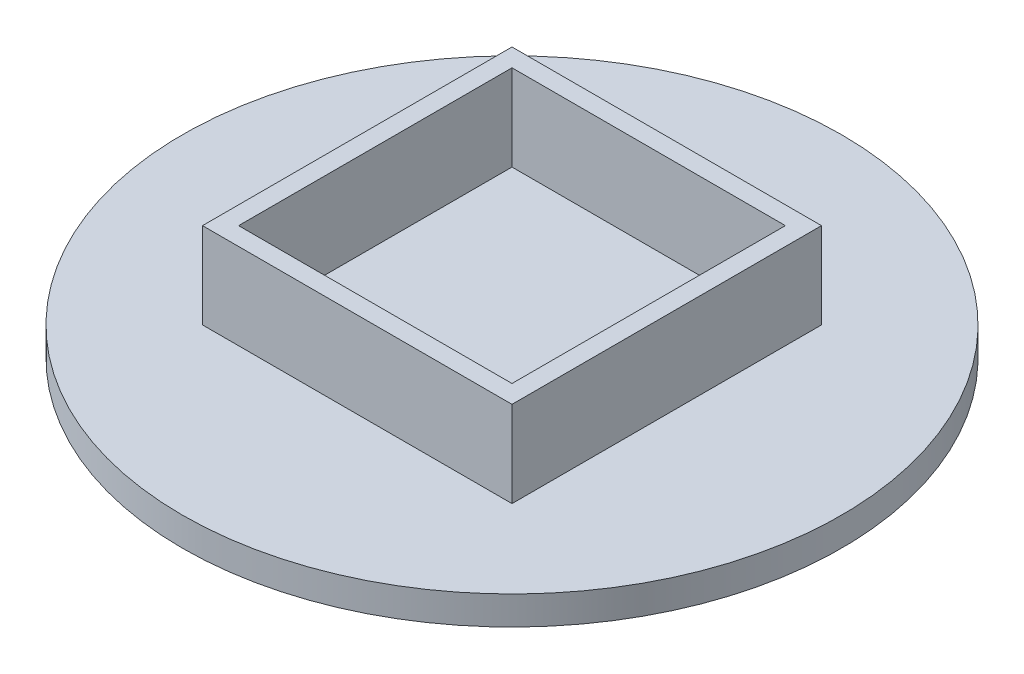
ISO-10303-21;
HEADER;
FILE_DESCRIPTION(('STEP AP214'),'2;1');
FILE_NAME('part.step','',(''),(''),'','','');
FILE_SCHEMA(('AUTOMOTIVE_DESIGN { 1 0 10303 214 1 1 1 1 }'));
ENDSEC;
DATA;
#1=APPLICATION_CONTEXT('core data for automotive mechanical design processes');
#2=APPLICATION_PROTOCOL_DEFINITION('international standard','automotive_design',2000,#1);
#3=PRODUCT_CONTEXT('',#1,'mechanical');
#4=PRODUCT('Part','Part','',(#3));
#5=PRODUCT_RELATED_PRODUCT_CATEGORY('part','',(#4));
#6=PRODUCT_DEFINITION_FORMATION('','',#4);
#7=PRODUCT_DEFINITION_CONTEXT('part definition',#1,'design');
#8=PRODUCT_DEFINITION('design','',#6,#7);
#9=PRODUCT_DEFINITION_SHAPE('','',#8);
#10=(LENGTH_UNIT() NAMED_UNIT(*) SI_UNIT(.MILLI.,.METRE.));
#11=(NAMED_UNIT(*) PLANE_ANGLE_UNIT() SI_UNIT($,.RADIAN.));
#12=(NAMED_UNIT(*) SI_UNIT($,.STERADIAN.) SOLID_ANGLE_UNIT());
#13=UNCERTAINTY_MEASURE_WITH_UNIT(LENGTH_MEASURE(1.E-05),#10,'distance_accuracy_value','');
#14=(GEOMETRIC_REPRESENTATION_CONTEXT(3) GLOBAL_UNCERTAINTY_ASSIGNED_CONTEXT((#13)) GLOBAL_UNIT_ASSIGNED_CONTEXT((#10,
#11,#12)) REPRESENTATION_CONTEXT('',''));
#15=CARTESIAN_POINT('',(0.,0.,0.));
#16=DIRECTION('',(0.,0.,1.));
#17=DIRECTION('',(1.,0.,0.));
#18=AXIS2_PLACEMENT_3D('',#15,#16,#17);
#19=CARTESIAN_POINT('',(0.,25.4,-30.29));
#20=DIRECTION('',(0.,0.,-1.));
#21=DIRECTION('',(-1.,0.,0.));
#22=AXIS2_PLACEMENT_3D('',#19,#20,#21);
#23=PLANE('',#22);
#24=DIRECTION('',(0.,-1.,0.));
#25=VECTOR('',#24,1.);
#26=CARTESIAN_POINT('',(-30.2900000000001,25.4,-30.29));
#27=LINE('',#26,#25);
#28=CARTESIAN_POINT('',(-30.2900000000001,25.4,-30.29));
#29=VERTEX_POINT('',#28);
#30=CARTESIAN_POINT('',(-30.2900000000001,6.35,-30.29));
#31=VERTEX_POINT('',#30);
#32=EDGE_CURVE('E112',#29,#31,#27,.T.);
#33=ORIENTED_EDGE('',*,*,#32,.T.);
#34=DIRECTION('',(1.,0.,0.));
#35=VECTOR('',#34,1.);
#36=CARTESIAN_POINT('',(0.,6.35,-30.29));
#37=LINE('',#36,#35);
#38=CARTESIAN_POINT('',(30.29,6.35,-30.29));
#39=VERTEX_POINT('',#38);
#40=EDGE_CURVE('E51',#31,#39,#37,.T.);
#41=ORIENTED_EDGE('',*,*,#40,.T.);
#42=DIRECTION('',(0.,-1.,0.));
#43=VECTOR('',#42,1.);
#44=CARTESIAN_POINT('',(30.29,25.4,-30.29));
#45=LINE('',#44,#43);
#46=CARTESIAN_POINT('',(30.29,25.4,-30.29));
#47=VERTEX_POINT('',#46);
#48=EDGE_CURVE('E44',#47,#39,#45,.T.);
#49=ORIENTED_EDGE('',*,*,#48,.F.);
#50=DIRECTION('',(1.,0.,0.));
#51=VECTOR('',#50,1.);
#52=CARTESIAN_POINT('',(0.,25.4,-30.29));
#53=LINE('',#52,#51);
#54=EDGE_CURVE('E144',#29,#47,#53,.T.);
#55=ORIENTED_EDGE('',*,*,#54,.F.);
#56=EDGE_LOOP('',(#33,#41,#49,#55));
#57=FACE_BOUND('',#56,.T.);
#58=ADVANCED_FACE('F36',(#57),#23,.F.);
#59=CARTESIAN_POINT('',(30.29,25.4,0.));
#60=DIRECTION('',(1.,0.,0.));
#61=DIRECTION('',(0.,0.,-1.));
#62=AXIS2_PLACEMENT_3D('',#59,#60,#61);
#63=PLANE('',#62);
#64=ORIENTED_EDGE('',*,*,#48,.T.);
#65=DIRECTION('',(0.,0.,1.));
#66=VECTOR('',#65,1.);
#67=CARTESIAN_POINT('',(30.29,6.35,0.));
#68=LINE('',#67,#66);
#69=CARTESIAN_POINT('',(30.29,6.35,30.29));
#70=VERTEX_POINT('',#69);
#71=EDGE_CURVE('E58',#39,#70,#68,.T.);
#72=ORIENTED_EDGE('',*,*,#71,.T.);
#73=DIRECTION('',(0.,-1.,0.));
#74=VECTOR('',#73,1.);
#75=CARTESIAN_POINT('',(30.29,25.4,30.29));
#76=LINE('',#75,#74);
#77=CARTESIAN_POINT('',(30.29,25.4,30.29));
#78=VERTEX_POINT('',#77);
#79=EDGE_CURVE('E111',#78,#70,#76,.T.);
#80=ORIENTED_EDGE('',*,*,#79,.F.);
#81=DIRECTION('',(0.,0.,1.));
#82=VECTOR('',#81,1.);
#83=CARTESIAN_POINT('',(30.29,25.4,0.));
#84=LINE('',#83,#82);
#85=EDGE_CURVE('E147',#47,#78,#84,.T.);
#86=ORIENTED_EDGE('',*,*,#85,.F.);
#87=EDGE_LOOP('',(#64,#72,#80,#86));
#88=FACE_BOUND('',#87,.T.);
#89=ADVANCED_FACE('F194',(#88),#63,.F.);
#90=CARTESIAN_POINT('',(0.,25.4,30.29));
#91=DIRECTION('',(0.,0.,-1.));
#92=DIRECTION('',(-1.,0.,0.));
#93=AXIS2_PLACEMENT_3D('',#90,#91,#92);
#94=PLANE('',#93);
#95=DIRECTION('',(1.,0.,0.));
#96=VECTOR('',#95,1.);
#97=CARTESIAN_POINT('',(0.,6.35,30.29));
#98=LINE('',#97,#96);
#99=CARTESIAN_POINT('',(-30.2900000000001,6.35,30.29));
#100=VERTEX_POINT('',#99);
#101=EDGE_CURVE('E115',#100,#70,#98,.T.);
#102=ORIENTED_EDGE('',*,*,#101,.F.);
#103=DIRECTION('',(0.,-1.,0.));
#104=VECTOR('',#103,1.);
#105=CARTESIAN_POINT('',(-30.2900000000001,25.4,30.29));
#106=LINE('',#105,#104);
#107=CARTESIAN_POINT('',(-30.2900000000001,25.4,30.29));
#108=VERTEX_POINT('',#107);
#109=EDGE_CURVE('E103',#108,#100,#106,.T.);
#110=ORIENTED_EDGE('',*,*,#109,.F.);
#111=DIRECTION('',(1.,0.,0.));
#112=VECTOR('',#111,1.);
#113=CARTESIAN_POINT('',(0.,25.4,30.29));
#114=LINE('',#113,#112);
#115=EDGE_CURVE('E149',#108,#78,#114,.T.);
#116=ORIENTED_EDGE('',*,*,#115,.T.);
#117=ORIENTED_EDGE('',*,*,#79,.T.);
#118=EDGE_LOOP('',(#102,#110,#116,#117));
#119=FACE_BOUND('',#118,.T.);
#120=ADVANCED_FACE('F116',(#119),#94,.T.);
#121=CARTESIAN_POINT('',(34.2900000000001,25.4,0.));
#122=DIRECTION('',(1.,0.,0.));
#123=DIRECTION('',(0.,0.,-1.));
#124=AXIS2_PLACEMENT_3D('',#121,#122,#123);
#125=PLANE('',#124);
#126=DIRECTION('',(0.,0.,1.));
#127=VECTOR('',#126,1.);
#128=CARTESIAN_POINT('',(34.2900000000001,6.35,0.));
#129=LINE('',#128,#127);
#130=CARTESIAN_POINT('',(34.2900000000001,6.35,-34.29));
#131=VERTEX_POINT('',#130);
#132=CARTESIAN_POINT('',(34.2900000000001,6.35,34.29));
#133=VERTEX_POINT('',#132);
#134=EDGE_CURVE('E132',#131,#133,#129,.T.);
#135=ORIENTED_EDGE('',*,*,#134,.F.);
#136=DIRECTION('',(0.,-1.,0.));
#137=VECTOR('',#136,1.);
#138=CARTESIAN_POINT('',(34.2900000000001,25.4,-34.29));
#139=LINE('',#138,#137);
#140=CARTESIAN_POINT('',(34.2900000000001,25.4,-34.29));
#141=VERTEX_POINT('',#140);
#142=EDGE_CURVE('E153',#141,#131,#139,.T.);
#143=ORIENTED_EDGE('',*,*,#142,.F.);
#144=DIRECTION('',(0.,0.,1.));
#145=VECTOR('',#144,1.);
#146=CARTESIAN_POINT('',(34.2900000000001,25.4,0.));
#147=LINE('',#146,#145);
#148=CARTESIAN_POINT('',(34.2900000000001,25.4,34.29));
#149=VERTEX_POINT('',#148);
#150=EDGE_CURVE('E134',#141,#149,#147,.T.);
#151=ORIENTED_EDGE('',*,*,#150,.T.);
#152=DIRECTION('',(0.,-1.,0.));
#153=VECTOR('',#152,1.);
#154=CARTESIAN_POINT('',(34.2900000000001,25.4,34.29));
#155=LINE('',#154,#153);
#156=EDGE_CURVE('E152',#149,#133,#155,.T.);
#157=ORIENTED_EDGE('',*,*,#156,.T.);
#158=EDGE_LOOP('',(#135,#143,#151,#157));
#159=FACE_BOUND('',#158,.T.);
#160=ADVANCED_FACE('F38',(#159),#125,.T.);
#161=CARTESIAN_POINT('',(0.,25.4,-34.29));
#162=DIRECTION('',(0.,0.,-1.));
#163=DIRECTION('',(-1.,0.,0.));
#164=AXIS2_PLACEMENT_3D('',#161,#162,#163);
#165=PLANE('',#164);
#166=DIRECTION('',(1.,0.,0.));
#167=VECTOR('',#166,1.);
#168=CARTESIAN_POINT('',(0.,6.35,-34.29));
#169=LINE('',#168,#167);
#170=CARTESIAN_POINT('',(-34.2900000000002,6.35,-34.29));
#171=VERTEX_POINT('',#170);
#172=EDGE_CURVE('E130',#171,#131,#169,.T.);
#173=ORIENTED_EDGE('',*,*,#172,.F.);
#174=DIRECTION('',(0.,-1.,0.));
#175=VECTOR('',#174,1.);
#176=CARTESIAN_POINT('',(-34.2900000000002,25.4,-34.29));
#177=LINE('',#176,#175);
#178=CARTESIAN_POINT('',(-34.2900000000002,25.4,-34.29));
#179=VERTEX_POINT('',#178);
#180=EDGE_CURVE('E162',#179,#171,#177,.T.);
#181=ORIENTED_EDGE('',*,*,#180,.F.);
#182=DIRECTION('',(1.,0.,0.));
#183=VECTOR('',#182,1.);
#184=CARTESIAN_POINT('',(0.,25.4,-34.29));
#185=LINE('',#184,#183);
#186=EDGE_CURVE('E137',#179,#141,#185,.T.);
#187=ORIENTED_EDGE('',*,*,#186,.T.);
#188=ORIENTED_EDGE('',*,*,#142,.T.);
#189=EDGE_LOOP('',(#173,#181,#187,#188));
#190=FACE_BOUND('',#189,.T.);
#191=ADVANCED_FACE('F167',(#190),#165,.T.);
#192=CARTESIAN_POINT('',(-34.2900000000002,25.4,0.));
#193=DIRECTION('',(1.,0.,0.));
#194=DIRECTION('',(0.,0.,-1.));
#195=AXIS2_PLACEMENT_3D('',#192,#193,#194);
#196=PLANE('',#195);
#197=ORIENTED_EDGE('',*,*,#180,.T.);
#198=DIRECTION('',(0.,0.,1.));
#199=VECTOR('',#198,1.);
#200=CARTESIAN_POINT('',(-34.2900000000002,6.35,0.));
#201=LINE('',#200,#199);
#202=CARTESIAN_POINT('',(-34.2900000000002,6.35,34.29));
#203=VERTEX_POINT('',#202);
#204=EDGE_CURVE('E124',#171,#203,#201,.T.);
#205=ORIENTED_EDGE('',*,*,#204,.T.);
#206=DIRECTION('',(0.,-1.,0.));
#207=VECTOR('',#206,1.);
#208=CARTESIAN_POINT('',(-34.2900000000002,25.4,34.29));
#209=LINE('',#208,#207);
#210=CARTESIAN_POINT('',(-34.2900000000002,25.4,34.29));
#211=VERTEX_POINT('',#210);
#212=EDGE_CURVE('E159',#211,#203,#209,.T.);
#213=ORIENTED_EDGE('',*,*,#212,.F.);
#214=DIRECTION('',(0.,0.,1.));
#215=VECTOR('',#214,1.);
#216=CARTESIAN_POINT('',(-34.2900000000002,25.4,0.));
#217=LINE('',#216,#215);
#218=EDGE_CURVE('E140',#179,#211,#217,.T.);
#219=ORIENTED_EDGE('',*,*,#218,.F.);
#220=EDGE_LOOP('',(#197,#205,#213,#219));
#221=FACE_BOUND('',#220,.T.);
#222=ADVANCED_FACE('F185',(#221),#196,.F.);
#223=CARTESIAN_POINT('',(0.,25.4,34.29));
#224=DIRECTION('',(0.,0.,-1.));
#225=DIRECTION('',(-1.,0.,0.));
#226=AXIS2_PLACEMENT_3D('',#223,#224,#225);
#227=PLANE('',#226);
#228=ORIENTED_EDGE('',*,*,#212,.T.);
#229=DIRECTION('',(1.,0.,0.));
#230=VECTOR('',#229,1.);
#231=CARTESIAN_POINT('',(0.,6.35,34.29));
#232=LINE('',#231,#230);
#233=EDGE_CURVE('E121',#203,#133,#232,.T.);
#234=ORIENTED_EDGE('',*,*,#233,.T.);
#235=ORIENTED_EDGE('',*,*,#156,.F.);
#236=DIRECTION('',(1.,0.,0.));
#237=VECTOR('',#236,1.);
#238=CARTESIAN_POINT('',(0.,25.4,34.29));
#239=LINE('',#238,#237);
#240=EDGE_CURVE('E142',#211,#149,#239,.T.);
#241=ORIENTED_EDGE('',*,*,#240,.F.);
#242=EDGE_LOOP('',(#228,#234,#235,#241));
#243=FACE_BOUND('',#242,.T.);
#244=ADVANCED_FACE('F180',(#243),#227,.F.);
#245=CARTESIAN_POINT('',(-30.2900000000001,25.4,0.));
#246=DIRECTION('',(1.,0.,0.));
#247=DIRECTION('',(0.,0.,-1.));
#248=AXIS2_PLACEMENT_3D('',#245,#246,#247);
#249=PLANE('',#248);
#250=DIRECTION('',(0.,0.,1.));
#251=VECTOR('',#250,1.);
#252=CARTESIAN_POINT('',(-30.2900000000001,6.35,0.));
#253=LINE('',#252,#251);
#254=EDGE_CURVE('E11',#31,#100,#253,.T.);
#255=ORIENTED_EDGE('',*,*,#254,.F.);
#256=ORIENTED_EDGE('',*,*,#32,.F.);
#257=DIRECTION('',(0.,0.,1.));
#258=VECTOR('',#257,1.);
#259=CARTESIAN_POINT('',(-30.2900000000001,25.4,0.));
#260=LINE('',#259,#258);
#261=EDGE_CURVE('E107',#29,#108,#260,.T.);
#262=ORIENTED_EDGE('',*,*,#261,.T.);
#263=ORIENTED_EDGE('',*,*,#109,.T.);
#264=EDGE_LOOP('',(#255,#256,#262,#263));
#265=FACE_BOUND('',#264,.T.);
#266=ADVANCED_FACE('F105',(#265),#249,.T.);
#267=CARTESIAN_POINT('',(0.,25.4,0.));
#268=DIRECTION('',(0.,1.,0.));
#269=DIRECTION('',(0.,0.,1.));
#270=AXIS2_PLACEMENT_3D('',#267,#268,#269);
#271=PLANE('',#270);
#272=ORIENTED_EDGE('',*,*,#150,.F.);
#273=ORIENTED_EDGE('',*,*,#186,.F.);
#274=ORIENTED_EDGE('',*,*,#218,.T.);
#275=ORIENTED_EDGE('',*,*,#240,.T.);
#276=EDGE_LOOP('',(#272,#273,#274,#275));
#277=FACE_BOUND('',#276,.T.);
#278=ORIENTED_EDGE('',*,*,#54,.T.);
#279=ORIENTED_EDGE('',*,*,#85,.T.);
#280=ORIENTED_EDGE('',*,*,#115,.F.);
#281=ORIENTED_EDGE('',*,*,#261,.F.);
#282=EDGE_LOOP('',(#278,#279,#280,#281));
#283=FACE_BOUND('',#282,.T.);
#284=ADVANCED_FACE('F173',(#277,#283),#271,.T.);
#285=CARTESIAN_POINT('',(0.,6.35,0.));
#286=DIRECTION('',(0.,1.,0.));
#287=DIRECTION('',(0.,0.,1.));
#288=AXIS2_PLACEMENT_3D('',#285,#286,#287);
#289=PLANE('',#288);
#290=ORIENTED_EDGE('',*,*,#40,.F.);
#291=ORIENTED_EDGE('',*,*,#254,.T.);
#292=ORIENTED_EDGE('',*,*,#101,.T.);
#293=ORIENTED_EDGE('',*,*,#71,.F.);
#294=EDGE_LOOP('',(#290,#291,#292,#293));
#295=FACE_BOUND('',#294,.T.);
#296=ADVANCED_FACE('F120',(#295),#289,.T.);
#297=CARTESIAN_POINT('',(0.,6.35,0.));
#298=DIRECTION('',(0.,-1.,0.));
#299=DIRECTION('',(0.,0.,-1.));
#300=AXIS2_PLACEMENT_3D('',#297,#298,#299);
#301=CYLINDRICAL_SURFACE('',#300,73.025);
#302=CARTESIAN_POINT('',(0.,6.35,0.));
#303=DIRECTION('',(0.,1.,0.));
#304=DIRECTION('',(0.,0.,1.));
#305=AXIS2_PLACEMENT_3D('',#302,#303,#304);
#306=CIRCLE('',#305,73.025);
#307=CARTESIAN_POINT('',(0.,6.35,73.025));
#308=VERTEX_POINT('',#307);
#309=EDGE_CURVE('E118',#308,#308,#306,.T.);
#310=ORIENTED_EDGE('',*,*,#309,.F.);
#311=EDGE_LOOP('',(#310));
#312=FACE_BOUND('',#311,.T.);
#313=CARTESIAN_POINT('',(0.,0.,0.));
#314=DIRECTION('',(0.,1.,0.));
#315=DIRECTION('',(0.,0.,1.));
#316=AXIS2_PLACEMENT_3D('',#313,#314,#315);
#317=CIRCLE('',#316,73.025);
#318=CARTESIAN_POINT('',(0.,0.,73.025));
#319=VERTEX_POINT('',#318);
#320=EDGE_CURVE('E300',#319,#319,#317,.T.);
#321=ORIENTED_EDGE('',*,*,#320,.T.);
#322=EDGE_LOOP('',(#321));
#323=FACE_BOUND('',#322,.T.);
#324=ADVANCED_FACE('F211',(#312,#323),#301,.T.);
#325=ORIENTED_EDGE('',*,*,#172,.T.);
#326=ORIENTED_EDGE('',*,*,#134,.T.);
#327=ORIENTED_EDGE('',*,*,#233,.F.);
#328=ORIENTED_EDGE('',*,*,#204,.F.);
#329=EDGE_LOOP('',(#325,#326,#327,#328));
#330=FACE_BOUND('',#329,.T.);
#331=ORIENTED_EDGE('',*,*,#309,.T.);
#332=EDGE_LOOP('',(#331));
#333=FACE_BOUND('',#332,.T.);
#334=ADVANCED_FACE('F182',(#330,#333),#289,.T.);
#335=CARTESIAN_POINT('',(0.,0.,0.));
#336=DIRECTION('',(0.,1.,0.));
#337=DIRECTION('',(0.,0.,1.));
#338=AXIS2_PLACEMENT_3D('',#335,#336,#337);
#339=PLANE('',#338);
#340=ORIENTED_EDGE('',*,*,#320,.F.);
#341=EDGE_LOOP('',(#340));
#342=FACE_BOUND('',#341,.T.);
#343=ADVANCED_FACE('F205',(#342),#339,.F.);
#344=CLOSED_SHELL('',(#58,#89,#120,#160,#191,#222,#244,#266,#284,#296,#324,#334,#343));
#345=MANIFOLD_SOLID_BREP('B2',#344);
#346=ADVANCED_BREP_SHAPE_REPRESENTATION('',(#18,#345),#14);
#347=SHAPE_DEFINITION_REPRESENTATION(#9,#346);
ENDSEC;
END-ISO-10303-21;
